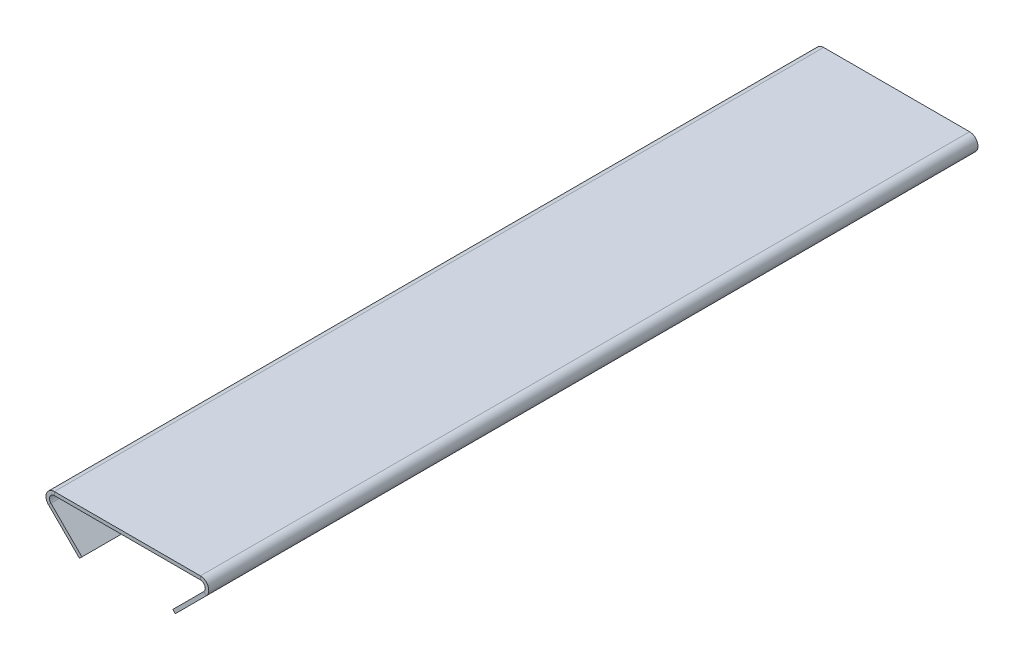
ISO-10303-21;
HEADER;
FILE_DESCRIPTION(('STEP AP214'),'2;1');
FILE_NAME('part.step','',(''),(''),'','','');
FILE_SCHEMA(('AUTOMOTIVE_DESIGN { 1 0 10303 214 1 1 1 1 }'));
ENDSEC;
DATA;
#1=APPLICATION_CONTEXT('core data for automotive mechanical design processes');
#2=APPLICATION_PROTOCOL_DEFINITION('international standard','automotive_design',2000,#1);
#3=PRODUCT_CONTEXT('',#1,'mechanical');
#4=PRODUCT('Part','Part','',(#3));
#5=PRODUCT_RELATED_PRODUCT_CATEGORY('part','',(#4));
#6=PRODUCT_DEFINITION_FORMATION('','',#4);
#7=PRODUCT_DEFINITION_CONTEXT('part definition',#1,'design');
#8=PRODUCT_DEFINITION('design','',#6,#7);
#9=PRODUCT_DEFINITION_SHAPE('','',#8);
#10=(LENGTH_UNIT() NAMED_UNIT(*) SI_UNIT(.MILLI.,.METRE.));
#11=(NAMED_UNIT(*) PLANE_ANGLE_UNIT() SI_UNIT($,.RADIAN.));
#12=(NAMED_UNIT(*) SI_UNIT($,.STERADIAN.) SOLID_ANGLE_UNIT());
#13=UNCERTAINTY_MEASURE_WITH_UNIT(LENGTH_MEASURE(1.E-05),#10,'distance_accuracy_value','');
#14=(GEOMETRIC_REPRESENTATION_CONTEXT(3) GLOBAL_UNCERTAINTY_ASSIGNED_CONTEXT((#13)) GLOBAL_UNIT_ASSIGNED_CONTEXT((#10,
#11,#12)) REPRESENTATION_CONTEXT('',''));
#15=CARTESIAN_POINT('',(0.,0.,0.));
#16=DIRECTION('',(0.,0.,1.));
#17=DIRECTION('',(1.,0.,0.));
#18=AXIS2_PLACEMENT_3D('',#15,#16,#17);
#19=CARTESIAN_POINT('',(0.,-1.36652,0.));
#20=DIRECTION('',(0.,1.,0.));
#21=DIRECTION('',(0.,0.,1.));
#22=AXIS2_PLACEMENT_3D('',#19,#20,#21);
#23=PLANE('',#22);
#24=DIRECTION('',(0.,0.,-1.));
#25=VECTOR('',#24,1.);
#26=CARTESIAN_POINT('',(-43.4683720464252,-1.36652000000001,-64.8734177215191));
#27=LINE('',#26,#25);
#28=CARTESIAN_POINT('',(-43.4683720464252,-1.36652000000001,-64.8734177215191));
#29=VERTEX_POINT('',#28);
#30=CARTESIAN_POINT('',(-43.4683720464252,-1.36651999999994,235.126582278481));
#31=VERTEX_POINT('',#30);
#32=EDGE_CURVE('E316',#29,#31,#27,.F.);
#33=ORIENTED_EDGE('',*,*,#32,.F.);
#34=DIRECTION('',(-1.,0.,0.));
#35=VECTOR('',#34,1.);
#36=CARTESIAN_POINT('',(-50.0000000000001,-1.36652,-64.8734177215191));
#37=LINE('',#36,#35);
#38=CARTESIAN_POINT('',(13.4683720464251,-1.36652000000003,-64.8734177215191));
#39=VERTEX_POINT('',#38);
#40=EDGE_CURVE('E13',#39,#29,#37,.T.);
#41=ORIENTED_EDGE('',*,*,#40,.F.);
#42=DIRECTION('',(0.,0.,1.));
#43=VECTOR('',#42,1.);
#44=CARTESIAN_POINT('',(13.4683720464251,-1.36652,235.126582278481));
#45=LINE('',#44,#43);
#46=CARTESIAN_POINT('',(13.4683720464251,-1.36652,235.126582278481));
#47=VERTEX_POINT('',#46);
#48=EDGE_CURVE('E144',#47,#39,#45,.F.);
#49=ORIENTED_EDGE('',*,*,#48,.F.);
#50=DIRECTION('',(1.,0.,0.));
#51=VECTOR('',#50,1.);
#52=CARTESIAN_POINT('',(-50.0000000000001,-1.36652,235.126582278481));
#53=LINE('',#52,#51);
#54=EDGE_CURVE('E85',#31,#47,#53,.T.);
#55=ORIENTED_EDGE('',*,*,#54,.F.);
#56=EDGE_LOOP('',(#33,#41,#49,#55));
#57=FACE_BOUND('',#56,.T.);
#58=ADVANCED_FACE('F76',(#57),#23,.F.);
#59=CARTESIAN_POINT('',(0.,0.,0.));
#60=DIRECTION('',(0.,1.,0.));
#61=DIRECTION('',(0.,0.,1.));
#62=AXIS2_PLACEMENT_3D('',#59,#60,#61);
#63=PLANE('',#62);
#64=DIRECTION('',(-1.,0.,0.));
#65=VECTOR('',#64,1.);
#66=CARTESIAN_POINT('',(-50.0000000000001,0.,-64.8734177215191));
#67=LINE('',#66,#65);
#68=CARTESIAN_POINT('',(13.4683720464251,0.,-64.8734177215191));
#69=VERTEX_POINT('',#68);
#70=CARTESIAN_POINT('',(-43.4683720464252,0.,-64.8734177215191));
#71=VERTEX_POINT('',#70);
#72=EDGE_CURVE('E80',#69,#71,#67,.T.);
#73=ORIENTED_EDGE('',*,*,#72,.T.);
#74=DIRECTION('',(0.,0.,-1.));
#75=VECTOR('',#74,1.);
#76=CARTESIAN_POINT('',(-43.4683720464252,0.,-64.8734177215191));
#77=LINE('',#76,#75);
#78=CARTESIAN_POINT('',(-43.4683720464252,0.,235.126582278481));
#79=VERTEX_POINT('',#78);
#80=EDGE_CURVE('E187',#71,#79,#77,.F.);
#81=ORIENTED_EDGE('',*,*,#80,.T.);
#82=DIRECTION('',(1.,0.,0.));
#83=VECTOR('',#82,1.);
#84=CARTESIAN_POINT('',(-50.0000000000001,0.,235.126582278481));
#85=LINE('',#84,#83);
#86=CARTESIAN_POINT('',(13.4683720464251,0.,235.126582278481));
#87=VERTEX_POINT('',#86);
#88=EDGE_CURVE('E102',#79,#87,#85,.T.);
#89=ORIENTED_EDGE('',*,*,#88,.T.);
#90=DIRECTION('',(0.,0.,1.));
#91=VECTOR('',#90,1.);
#92=CARTESIAN_POINT('',(13.4683720464251,0.,235.126582278481));
#93=LINE('',#92,#91);
#94=EDGE_CURVE('E171',#87,#69,#93,.F.);
#95=ORIENTED_EDGE('',*,*,#94,.T.);
#96=EDGE_LOOP('',(#73,#81,#89,#95));
#97=FACE_BOUND('',#96,.T.);
#98=ADVANCED_FACE('F184',(#97),#63,.T.);
#99=CARTESIAN_POINT('',(-50.0000000000001,-1.36652,-64.8734177215191));
#100=DIRECTION('',(0.,0.,-1.));
#101=DIRECTION('',(-1.,0.,0.));
#102=AXIS2_PLACEMENT_3D('',#99,#100,#101);
#103=PLANE('',#102);
#104=ORIENTED_EDGE('',*,*,#40,.T.);
#105=DIRECTION('',(0.,1.,0.));
#106=VECTOR('',#105,1.);
#107=CARTESIAN_POINT('',(-43.4683720464252,-1.36652000000001,-64.8734177215191));
#108=LINE('',#107,#106);
#109=EDGE_CURVE('E196',#29,#71,#108,.T.);
#110=ORIENTED_EDGE('',*,*,#109,.T.);
#111=ORIENTED_EDGE('',*,*,#72,.F.);
#112=DIRECTION('',(0.,1.,0.));
#113=VECTOR('',#112,1.);
#114=CARTESIAN_POINT('',(13.4683720464251,-1.36652000000003,-64.8734177215191));
#115=LINE('',#114,#113);
#116=EDGE_CURVE('E178',#39,#69,#115,.T.);
#117=ORIENTED_EDGE('',*,*,#116,.F.);
#118=EDGE_LOOP('',(#104,#110,#111,#117));
#119=FACE_BOUND('',#118,.T.);
#120=ADVANCED_FACE('F193',(#119),#103,.T.);
#121=CARTESIAN_POINT('',(-50.0000000000001,-1.36652,235.126582278481));
#122=DIRECTION('',(0.,0.,1.));
#123=DIRECTION('',(1.,0.,0.));
#124=AXIS2_PLACEMENT_3D('',#121,#122,#123);
#125=PLANE('',#124);
#126=DIRECTION('',(0.,1.,0.));
#127=VECTOR('',#126,1.);
#128=CARTESIAN_POINT('',(-43.4683720464252,-1.36651999999994,235.126582278481));
#129=LINE('',#128,#127);
#130=EDGE_CURVE('E170',#31,#79,#129,.T.);
#131=ORIENTED_EDGE('',*,*,#130,.F.);
#132=ORIENTED_EDGE('',*,*,#54,.T.);
#133=DIRECTION('',(0.,1.,0.));
#134=VECTOR('',#133,1.);
#135=CARTESIAN_POINT('',(13.4683720464251,-1.36652,235.126582278481));
#136=LINE('',#135,#134);
#137=EDGE_CURVE('E143',#47,#87,#136,.T.);
#138=ORIENTED_EDGE('',*,*,#137,.T.);
#139=ORIENTED_EDGE('',*,*,#88,.F.);
#140=EDGE_LOOP('',(#131,#132,#138,#139));
#141=FACE_BOUND('',#140,.T.);
#142=ADVANCED_FACE('F78',(#141),#125,.T.);
#143=CARTESIAN_POINT('',(13.4683720464251,-3.27152000000001,-64.8734177215191));
#144=DIRECTION('',(0.,0.,-1.));
#145=DIRECTION('',(0.,1.,0.));
#146=AXIS2_PLACEMENT_3D('',#143,#144,#145);
#147=PLANE('',#146);
#148=DIRECTION('',(0.707106781186549,-0.707106781186546,0.));
#149=VECTOR('',#148,1.);
#150=CARTESIAN_POINT('',(15.7816860232125,-5.58483397678741,-64.8734177215191));
#151=LINE('',#150,#149);
#152=CARTESIAN_POINT('',(14.8154104645854,-4.61855841816036,-64.8734177215191));
#153=VERTEX_POINT('',#152);
#154=CARTESIAN_POINT('',(15.7816860232125,-5.5848339767874,-64.8734177215191));
#155=VERTEX_POINT('',#154);
#156=EDGE_CURVE('E133',#153,#155,#151,.T.);
#157=ORIENTED_EDGE('',*,*,#156,.F.);
#158=CARTESIAN_POINT('',(13.4683720464251,-3.27152000000001,-64.8734177215191));
#159=DIRECTION('',(0.,0.,1.));
#160=DIRECTION('',(0.,-1.,0.));
#161=AXIS2_PLACEMENT_3D('',#158,#159,#160);
#162=CIRCLE('',#161,1.90499999999998);
#163=EDGE_CURVE('E127',#39,#153,#162,.F.);
#164=ORIENTED_EDGE('',*,*,#163,.F.);
#165=ORIENTED_EDGE('',*,*,#116,.T.);
#166=CARTESIAN_POINT('',(13.4683720464251,-3.27152000000001,-64.8734177215191));
#167=DIRECTION('',(0.,0.,1.));
#168=DIRECTION('',(0.,-1.,0.));
#169=AXIS2_PLACEMENT_3D('',#166,#167,#168);
#170=CIRCLE('',#169,3.27151999999997);
#171=EDGE_CURVE('E93',#69,#155,#170,.F.);
#172=ORIENTED_EDGE('',*,*,#171,.T.);
#173=EDGE_LOOP('',(#157,#164,#165,#172));
#174=FACE_BOUND('',#173,.T.);
#175=ADVANCED_FACE('F354',(#174),#147,.T.);
#176=CARTESIAN_POINT('',(13.4683720464251,-3.27151999999998,235.126582278481));
#177=DIRECTION('',(0.,0.,-1.));
#178=DIRECTION('',(0.,1.,0.));
#179=AXIS2_PLACEMENT_3D('',#176,#177,#178);
#180=PLANE('',#179);
#181=CARTESIAN_POINT('',(13.4683720464251,-3.27151999999998,235.126582278481));
#182=DIRECTION('',(0.,0.,1.));
#183=DIRECTION('',(0.,-1.,0.));
#184=AXIS2_PLACEMENT_3D('',#181,#182,#183);
#185=CIRCLE('',#184,1.90499999999998);
#186=CARTESIAN_POINT('',(14.8154104645854,-4.61855841816033,235.126582278481));
#187=VERTEX_POINT('',#186);
#188=EDGE_CURVE('E124',#187,#47,#185,.T.);
#189=ORIENTED_EDGE('',*,*,#188,.F.);
#190=DIRECTION('',(0.707106781186549,-0.707106781186546,0.));
#191=VECTOR('',#190,1.);
#192=CARTESIAN_POINT('',(14.8154104645855,-4.61855841816036,235.126582278481));
#193=LINE('',#192,#191);
#194=CARTESIAN_POINT('',(15.7816860232125,-5.5848339767874,235.126582278481));
#195=VERTEX_POINT('',#194);
#196=EDGE_CURVE('E132',#187,#195,#193,.T.);
#197=ORIENTED_EDGE('',*,*,#196,.T.);
#198=CARTESIAN_POINT('',(13.4683720464251,-3.27151999999998,235.126582278481));
#199=DIRECTION('',(0.,0.,1.));
#200=DIRECTION('',(0.,-1.,0.));
#201=AXIS2_PLACEMENT_3D('',#198,#199,#200);
#202=CIRCLE('',#201,3.27151999999997);
#203=EDGE_CURVE('E173',#195,#87,#202,.T.);
#204=ORIENTED_EDGE('',*,*,#203,.T.);
#205=ORIENTED_EDGE('',*,*,#137,.F.);
#206=EDGE_LOOP('',(#189,#197,#204,#205));
#207=FACE_BOUND('',#206,.T.);
#208=ADVANCED_FACE('F138',(#207),#180,.F.);
#209=CARTESIAN_POINT('',(13.4683720464251,-3.27151999999998,235.126582278481));
#210=DIRECTION('',(0.,0.,1.));
#211=DIRECTION('',(0.707106781186549,-0.707106781186546,0.));
#212=AXIS2_PLACEMENT_3D('',#209,#210,#211);
#213=CYLINDRICAL_SURFACE('',#212,3.27151999999997);
#214=ORIENTED_EDGE('',*,*,#94,.F.);
#215=ORIENTED_EDGE('',*,*,#203,.F.);
#216=DIRECTION('',(0.,0.,1.));
#217=VECTOR('',#216,1.);
#218=CARTESIAN_POINT('',(15.7816860232125,-5.58483397678741,0.));
#219=LINE('',#218,#217);
#220=EDGE_CURVE('E162',#155,#195,#219,.T.);
#221=ORIENTED_EDGE('',*,*,#220,.F.);
#222=ORIENTED_EDGE('',*,*,#171,.F.);
#223=EDGE_LOOP('',(#214,#215,#221,#222));
#224=FACE_BOUND('',#223,.T.);
#225=ADVANCED_FACE('F365',(#224),#213,.T.);
#226=CARTESIAN_POINT('',(13.4683720464251,-3.27151999999998,235.126582278481));
#227=DIRECTION('',(0.,0.,1.));
#228=DIRECTION('',(0.707106781186549,-0.707106781186546,0.));
#229=AXIS2_PLACEMENT_3D('',#226,#227,#228);
#230=CYLINDRICAL_SURFACE('',#229,1.90499999999998);
#231=ORIENTED_EDGE('',*,*,#48,.T.);
#232=ORIENTED_EDGE('',*,*,#163,.T.);
#233=DIRECTION('',(0.,0.,-1.));
#234=VECTOR('',#233,1.);
#235=CARTESIAN_POINT('',(14.8154104645854,-4.61855841816037,-64.8734177215191));
#236=LINE('',#235,#234);
#237=EDGE_CURVE('E121',#153,#187,#236,.F.);
#238=ORIENTED_EDGE('',*,*,#237,.T.);
#239=ORIENTED_EDGE('',*,*,#188,.T.);
#240=EDGE_LOOP('',(#231,#232,#238,#239));
#241=FACE_BOUND('',#240,.T.);
#242=ADVANCED_FACE('F123',(#241),#230,.F.);
#243=CARTESIAN_POINT('',(19.0337244413729,-2.33279555862704,235.126582278481));
#244=DIRECTION('',(0.,0.,1.));
#245=DIRECTION('',(1.,0.,0.));
#246=AXIS2_PLACEMENT_3D('',#243,#244,#245);
#247=PLANE('',#246);
#248=DIRECTION('',(0.707106781186546,0.707106781186549,0.));
#249=VECTOR('',#248,1.);
#250=CARTESIAN_POINT('',(19.0337244413729,-2.33279555862704,235.126582278481));
#251=LINE('',#250,#249);
#252=CARTESIAN_POINT('',(3.68885047033623,-17.6776695296637,235.126582278481));
#253=VERTEX_POINT('',#252);
#254=EDGE_CURVE('E161',#253,#195,#251,.T.);
#255=ORIENTED_EDGE('',*,*,#254,.T.);
#256=ORIENTED_EDGE('',*,*,#196,.F.);
#257=DIRECTION('',(-0.707106781186546,-0.707106781186549,0.));
#258=VECTOR('',#257,1.);
#259=CARTESIAN_POINT('',(8.75070888274591,-10.6832599999999,235.126582278481));
#260=LINE('',#259,#258);
#261=CARTESIAN_POINT('',(2.72257491170919,-16.7113939710367,235.126582278481));
#262=VERTEX_POINT('',#261);
#263=EDGE_CURVE('E149',#262,#187,#260,.F.);
#264=ORIENTED_EDGE('',*,*,#263,.F.);
#265=DIRECTION('',(-0.707106781186549,0.707106781186546,0.));
#266=VECTOR('',#265,1.);
#267=CARTESIAN_POINT('',(3.68885047033623,-17.6776695296637,235.126582278481));
#268=LINE('',#267,#266);
#269=EDGE_CURVE('E145',#253,#262,#268,.T.);
#270=ORIENTED_EDGE('',*,*,#269,.F.);
#271=EDGE_LOOP('',(#255,#256,#264,#270));
#272=FACE_BOUND('',#271,.T.);
#273=ADVANCED_FACE('F159',(#272),#247,.T.);
#274=CARTESIAN_POINT('',(3.68885047033619,-17.6776695296637,-64.8734177215191));
#275=DIRECTION('',(0.,0.,-1.));
#276=DIRECTION('',(-1.,0.,0.));
#277=AXIS2_PLACEMENT_3D('',#274,#275,#276);
#278=PLANE('',#277);
#279=DIRECTION('',(0.707106781186546,0.707106781186549,0.));
#280=VECTOR('',#279,1.);
#281=CARTESIAN_POINT('',(8.75070888274588,-10.6832599999999,-64.8734177215191));
#282=LINE('',#281,#280);
#283=CARTESIAN_POINT('',(2.72257491170915,-16.7113939710367,-64.8734177215191));
#284=VERTEX_POINT('',#283);
#285=EDGE_CURVE('E164',#153,#284,#282,.F.);
#286=ORIENTED_EDGE('',*,*,#285,.F.);
#287=ORIENTED_EDGE('',*,*,#156,.T.);
#288=DIRECTION('',(-0.707106781186546,-0.707106781186549,0.));
#289=VECTOR('',#288,1.);
#290=CARTESIAN_POINT('',(3.68885047033619,-17.6776695296637,-64.8734177215191));
#291=LINE('',#290,#289);
#292=CARTESIAN_POINT('',(3.68885047033619,-17.6776695296637,-64.8734177215191));
#293=VERTEX_POINT('',#292);
#294=EDGE_CURVE('E156',#155,#293,#291,.T.);
#295=ORIENTED_EDGE('',*,*,#294,.T.);
#296=DIRECTION('',(-0.707106781186549,0.707106781186546,0.));
#297=VECTOR('',#296,1.);
#298=CARTESIAN_POINT('',(3.68885047033619,-17.6776695296637,-64.8734177215191));
#299=LINE('',#298,#297);
#300=EDGE_CURVE('E212',#293,#284,#299,.T.);
#301=ORIENTED_EDGE('',*,*,#300,.T.);
#302=EDGE_LOOP('',(#286,#287,#295,#301));
#303=FACE_BOUND('',#302,.T.);
#304=ADVANCED_FACE('F224',(#303),#278,.T.);
#305=CARTESIAN_POINT('',(9.71698444137293,-11.649535558627,0.));
#306=DIRECTION('',(0.707106781186549,-0.707106781186546,0.));
#307=DIRECTION('',(0.707106781186546,0.707106781186549,0.));
#308=AXIS2_PLACEMENT_3D('',#305,#306,#307);
#309=PLANE('',#308);
#310=ORIENTED_EDGE('',*,*,#294,.F.);
#311=ORIENTED_EDGE('',*,*,#220,.T.);
#312=ORIENTED_EDGE('',*,*,#254,.F.);
#313=DIRECTION('',(0.,0.,1.));
#314=VECTOR('',#313,1.);
#315=CARTESIAN_POINT('',(3.68885047033623,-17.6776695296637,235.126582278481));
#316=LINE('',#315,#314);
#317=EDGE_CURVE('E216',#293,#253,#316,.T.);
#318=ORIENTED_EDGE('',*,*,#317,.F.);
#319=EDGE_LOOP('',(#310,#311,#312,#318));
#320=FACE_BOUND('',#319,.T.);
#321=ADVANCED_FACE('F364',(#320),#309,.T.);
#322=CARTESIAN_POINT('',(8.75070888274589,-10.6832599999999,0.));
#323=DIRECTION('',(0.707106781186549,-0.707106781186546,0.));
#324=DIRECTION('',(0.707106781186546,0.707106781186549,0.));
#325=AXIS2_PLACEMENT_3D('',#322,#323,#324);
#326=PLANE('',#325);
#327=ORIENTED_EDGE('',*,*,#237,.F.);
#328=ORIENTED_EDGE('',*,*,#285,.T.);
#329=DIRECTION('',(0.,0.,-1.));
#330=VECTOR('',#329,1.);
#331=CARTESIAN_POINT('',(2.72257491170916,-16.7113939710367,0.));
#332=LINE('',#331,#330);
#333=EDGE_CURVE('E153',#284,#262,#332,.F.);
#334=ORIENTED_EDGE('',*,*,#333,.T.);
#335=ORIENTED_EDGE('',*,*,#263,.T.);
#336=EDGE_LOOP('',(#327,#328,#334,#335));
#337=FACE_BOUND('',#336,.T.);
#338=ADVANCED_FACE('F150',(#337),#326,.F.);
#339=CARTESIAN_POINT('',(3.68885047033623,-17.6776695296637,235.126582278481));
#340=DIRECTION('',(-0.707106781186546,-0.707106781186549,0.));
#341=DIRECTION('',(0.707106781186549,-0.707106781186546,0.));
#342=AXIS2_PLACEMENT_3D('',#339,#340,#341);
#343=PLANE('',#342);
#344=ORIENTED_EDGE('',*,*,#333,.F.);
#345=ORIENTED_EDGE('',*,*,#300,.F.);
#346=ORIENTED_EDGE('',*,*,#317,.T.);
#347=ORIENTED_EDGE('',*,*,#269,.T.);
#348=EDGE_LOOP('',(#344,#345,#346,#347));
#349=FACE_BOUND('',#348,.T.);
#350=ADVANCED_FACE('F229',(#349),#343,.T.);
#351=CARTESIAN_POINT('',(-43.4683720464253,-3.27151999999999,235.126582278481));
#352=DIRECTION('',(0.,0.,1.));
#353=DIRECTION('',(0.,-1.,0.));
#354=AXIS2_PLACEMENT_3D('',#351,#352,#353);
#355=PLANE('',#354);
#356=DIRECTION('',(0.707106781186549,0.707106781186546,0.));
#357=VECTOR('',#356,1.);
#358=CARTESIAN_POINT('',(-45.7816860232127,-5.58483397678741,235.126582278481));
#359=LINE('',#358,#357);
#360=CARTESIAN_POINT('',(-44.8154104645857,-4.61855841816039,235.126582278481));
#361=VERTEX_POINT('',#360);
#362=CARTESIAN_POINT('',(-45.7816860232127,-5.58483397678743,235.126582278481));
#363=VERTEX_POINT('',#362);
#364=EDGE_CURVE('E292',#361,#363,#359,.F.);
#365=ORIENTED_EDGE('',*,*,#364,.F.);
#366=CARTESIAN_POINT('',(-43.4683720464253,-3.27151999999999,235.126582278481));
#367=DIRECTION('',(0.,0.,-1.));
#368=DIRECTION('',(0.,1.,0.));
#369=AXIS2_PLACEMENT_3D('',#366,#367,#368);
#370=CIRCLE('',#369,1.90500000000005);
#371=EDGE_CURVE('E313',#31,#361,#370,.F.);
#372=ORIENTED_EDGE('',*,*,#371,.F.);
#373=ORIENTED_EDGE('',*,*,#130,.T.);
#374=CARTESIAN_POINT('',(-43.4683720464253,-3.27151999999999,235.126582278481));
#375=DIRECTION('',(0.,0.,-1.));
#376=DIRECTION('',(0.,1.,0.));
#377=AXIS2_PLACEMENT_3D('',#374,#375,#376);
#378=CIRCLE('',#377,3.27152000000005);
#379=EDGE_CURVE('E202',#79,#363,#378,.F.);
#380=ORIENTED_EDGE('',*,*,#379,.T.);
#381=EDGE_LOOP('',(#365,#372,#373,#380));
#382=FACE_BOUND('',#381,.T.);
#383=ADVANCED_FACE('F378',(#382),#355,.T.);
#384=CARTESIAN_POINT('',(-43.4683720464253,-3.27152000000005,-64.8734177215191));
#385=DIRECTION('',(0.,0.,1.));
#386=DIRECTION('',(0.,-1.,0.));
#387=AXIS2_PLACEMENT_3D('',#384,#385,#386);
#388=PLANE('',#387);
#389=CARTESIAN_POINT('',(-43.4683720464253,-3.27152000000005,-64.8734177215191));
#390=DIRECTION('',(0.,0.,-1.));
#391=DIRECTION('',(0.,1.,0.));
#392=AXIS2_PLACEMENT_3D('',#389,#390,#391);
#393=CIRCLE('',#392,1.90500000000005);
#394=CARTESIAN_POINT('',(-44.8154104645857,-4.61855841816045,-64.8734177215191));
#395=VERTEX_POINT('',#394);
#396=EDGE_CURVE('E317',#395,#29,#393,.T.);
#397=ORIENTED_EDGE('',*,*,#396,.F.);
#398=DIRECTION('',(0.707106781186549,0.707106781186546,0.));
#399=VECTOR('',#398,1.);
#400=CARTESIAN_POINT('',(-44.8154104645856,-4.61855841816041,-64.8734177215191));
#401=LINE('',#400,#399);
#402=CARTESIAN_POINT('',(-45.7816860232127,-5.58483397678745,-64.8734177215191));
#403=VERTEX_POINT('',#402);
#404=EDGE_CURVE('E304',#395,#403,#401,.F.);
#405=ORIENTED_EDGE('',*,*,#404,.T.);
#406=CARTESIAN_POINT('',(-43.4683720464253,-3.27152000000005,-64.8734177215191));
#407=DIRECTION('',(0.,0.,-1.));
#408=DIRECTION('',(0.,1.,0.));
#409=AXIS2_PLACEMENT_3D('',#406,#407,#408);
#410=CIRCLE('',#409,3.27152000000005);
#411=EDGE_CURVE('E310',#403,#71,#410,.T.);
#412=ORIENTED_EDGE('',*,*,#411,.T.);
#413=ORIENTED_EDGE('',*,*,#109,.F.);
#414=EDGE_LOOP('',(#397,#405,#412,#413));
#415=FACE_BOUND('',#414,.T.);
#416=ADVANCED_FACE('F328',(#415),#388,.F.);
#417=CARTESIAN_POINT('',(-43.4683720464253,-3.27152000000005,-64.8734177215191));
#418=DIRECTION('',(0.,0.,-1.));
#419=DIRECTION('',(-0.707106781186549,-0.707106781186546,0.));
#420=AXIS2_PLACEMENT_3D('',#417,#418,#419);
#421=CYLINDRICAL_SURFACE('',#420,3.27152000000005);
#422=ORIENTED_EDGE('',*,*,#80,.F.);
#423=ORIENTED_EDGE('',*,*,#411,.F.);
#424=DIRECTION('',(0.,0.,-1.));
#425=VECTOR('',#424,1.);
#426=CARTESIAN_POINT('',(-45.7816860232127,-5.58483397678742,235.126582278481));
#427=LINE('',#426,#425);
#428=EDGE_CURVE('E302',#403,#363,#427,.F.);
#429=ORIENTED_EDGE('',*,*,#428,.T.);
#430=ORIENTED_EDGE('',*,*,#379,.F.);
#431=EDGE_LOOP('',(#422,#423,#429,#430));
#432=FACE_BOUND('',#431,.T.);
#433=ADVANCED_FACE('F337',(#432),#421,.T.);
#434=CARTESIAN_POINT('',(-43.4683720464253,-3.27152000000005,-64.8734177215191));
#435=DIRECTION('',(0.,0.,-1.));
#436=DIRECTION('',(-0.707106781186549,-0.707106781186546,0.));
#437=AXIS2_PLACEMENT_3D('',#434,#435,#436);
#438=CYLINDRICAL_SURFACE('',#437,1.90500000000005);
#439=ORIENTED_EDGE('',*,*,#32,.T.);
#440=ORIENTED_EDGE('',*,*,#371,.T.);
#441=DIRECTION('',(0.,0.,-1.));
#442=VECTOR('',#441,1.);
#443=CARTESIAN_POINT('',(-44.8154104645857,-4.61855841816038,235.126582278481));
#444=LINE('',#443,#442);
#445=EDGE_CURVE('E307',#361,#395,#444,.T.);
#446=ORIENTED_EDGE('',*,*,#445,.T.);
#447=ORIENTED_EDGE('',*,*,#396,.T.);
#448=EDGE_LOOP('',(#439,#440,#446,#447));
#449=FACE_BOUND('',#448,.T.);
#450=ADVANCED_FACE('F325',(#449),#438,.F.);
#451=CARTESIAN_POINT('',(-33.6888504703364,-17.6776695296637,-64.8734177215191));
#452=DIRECTION('',(0.,0.,1.));
#453=DIRECTION('',(1.,0.,0.));
#454=AXIS2_PLACEMENT_3D('',#451,#452,#453);
#455=PLANE('',#454);
#456=ORIENTED_EDGE('',*,*,#404,.F.);
#457=DIRECTION('',(-0.707106781186546,0.707106781186549,0.));
#458=VECTOR('',#457,1.);
#459=CARTESIAN_POINT('',(-32.7225749117094,-16.7113939710367,-64.8734177215191));
#460=LINE('',#459,#458);
#461=CARTESIAN_POINT('',(-32.7225749117094,-16.7113939710367,-64.8734177215191));
#462=VERTEX_POINT('',#461);
#463=EDGE_CURVE('E300',#395,#462,#460,.F.);
#464=ORIENTED_EDGE('',*,*,#463,.T.);
#465=DIRECTION('',(0.707106781186549,0.707106781186546,0.));
#466=VECTOR('',#465,1.);
#467=CARTESIAN_POINT('',(-33.6888504703364,-17.6776695296637,-64.8734177215191));
#468=LINE('',#467,#466);
#469=CARTESIAN_POINT('',(-33.6888504703364,-17.6776695296637,-64.8734177215191));
#470=VERTEX_POINT('',#469);
#471=EDGE_CURVE('E288',#470,#462,#468,.T.);
#472=ORIENTED_EDGE('',*,*,#471,.F.);
#473=DIRECTION('',(0.707106781186546,-0.707106781186549,0.));
#474=VECTOR('',#473,1.);
#475=CARTESIAN_POINT('',(-24.7169844413731,-26.6495355586271,-64.8734177215191));
#476=LINE('',#475,#474);
#477=EDGE_CURVE('E275',#403,#470,#476,.T.);
#478=ORIENTED_EDGE('',*,*,#477,.F.);
#479=EDGE_LOOP('',(#456,#464,#472,#478));
#480=FACE_BOUND('',#479,.T.);
#481=ADVANCED_FACE('F329',(#480),#455,.F.);
#482=CARTESIAN_POINT('',(-49.0337244413731,-2.33279555862704,235.126582278481));
#483=DIRECTION('',(0.,0.,-1.));
#484=DIRECTION('',(-1.,0.,0.));
#485=AXIS2_PLACEMENT_3D('',#482,#483,#484);
#486=PLANE('',#485);
#487=ORIENTED_EDGE('',*,*,#364,.T.);
#488=DIRECTION('',(-0.707106781186546,0.707106781186549,0.));
#489=VECTOR('',#488,1.);
#490=CARTESIAN_POINT('',(-24.7169844413731,-26.6495355586271,235.126582278481));
#491=LINE('',#490,#489);
#492=CARTESIAN_POINT('',(-33.6888504703365,-17.6776695296637,235.126582278481));
#493=VERTEX_POINT('',#492);
#494=EDGE_CURVE('E273',#493,#363,#491,.T.);
#495=ORIENTED_EDGE('',*,*,#494,.F.);
#496=DIRECTION('',(0.707106781186549,0.707106781186546,0.));
#497=VECTOR('',#496,1.);
#498=CARTESIAN_POINT('',(-33.6888504703365,-17.6776695296637,235.126582278481));
#499=LINE('',#498,#497);
#500=CARTESIAN_POINT('',(-32.7225749117094,-16.7113939710367,235.126582278481));
#501=VERTEX_POINT('',#500);
#502=EDGE_CURVE('E281',#493,#501,#499,.T.);
#503=ORIENTED_EDGE('',*,*,#502,.T.);
#504=DIRECTION('',(0.707106781186546,-0.707106781186549,0.));
#505=VECTOR('',#504,1.);
#506=CARTESIAN_POINT('',(-48.0674488827461,-1.36652,235.126582278481));
#507=LINE('',#506,#505);
#508=EDGE_CURVE('E297',#501,#361,#507,.F.);
#509=ORIENTED_EDGE('',*,*,#508,.T.);
#510=EDGE_LOOP('',(#487,#495,#503,#509));
#511=FACE_BOUND('',#510,.T.);
#512=ADVANCED_FACE('F291',(#511),#486,.F.);
#513=CARTESIAN_POINT('',(-24.7169844413731,-26.6495355586271,0.));
#514=DIRECTION('',(0.707106781186549,0.707106781186546,0.));
#515=DIRECTION('',(-0.707106781186546,0.707106781186549,0.));
#516=AXIS2_PLACEMENT_3D('',#513,#514,#515);
#517=PLANE('',#516);
#518=ORIENTED_EDGE('',*,*,#428,.F.);
#519=ORIENTED_EDGE('',*,*,#477,.T.);
#520=DIRECTION('',(0.,0.,1.));
#521=VECTOR('',#520,1.);
#522=CARTESIAN_POINT('',(-33.6888504703364,-17.6776695296637,0.));
#523=LINE('',#522,#521);
#524=EDGE_CURVE('E268',#470,#493,#523,.T.);
#525=ORIENTED_EDGE('',*,*,#524,.T.);
#526=ORIENTED_EDGE('',*,*,#494,.T.);
#527=EDGE_LOOP('',(#518,#519,#525,#526));
#528=FACE_BOUND('',#527,.T.);
#529=ADVANCED_FACE('F271',(#528),#517,.F.);
#530=CARTESIAN_POINT('',(-23.7507088827461,-25.68326,0.));
#531=DIRECTION('',(0.707106781186549,0.707106781186546,0.));
#532=DIRECTION('',(-0.707106781186546,0.707106781186549,0.));
#533=AXIS2_PLACEMENT_3D('',#530,#531,#532);
#534=PLANE('',#533);
#535=ORIENTED_EDGE('',*,*,#463,.F.);
#536=ORIENTED_EDGE('',*,*,#445,.F.);
#537=ORIENTED_EDGE('',*,*,#508,.F.);
#538=DIRECTION('',(0.,0.,-1.));
#539=VECTOR('',#538,1.);
#540=CARTESIAN_POINT('',(-32.7225749117094,-16.7113939710367,235.126582278481));
#541=LINE('',#540,#539);
#542=EDGE_CURVE('E284',#462,#501,#541,.F.);
#543=ORIENTED_EDGE('',*,*,#542,.F.);
#544=EDGE_LOOP('',(#535,#536,#537,#543));
#545=FACE_BOUND('',#544,.T.);
#546=ADVANCED_FACE('F323',(#545),#534,.T.);
#547=CARTESIAN_POINT('',(-33.6888504703365,-17.6776695296637,235.126582278481));
#548=DIRECTION('',(-0.707106781186546,0.707106781186549,0.));
#549=DIRECTION('',(-0.707106781186549,-0.707106781186546,0.));
#550=AXIS2_PLACEMENT_3D('',#547,#548,#549);
#551=PLANE('',#550);
#552=ORIENTED_EDGE('',*,*,#542,.T.);
#553=ORIENTED_EDGE('',*,*,#502,.F.);
#554=ORIENTED_EDGE('',*,*,#524,.F.);
#555=ORIENTED_EDGE('',*,*,#471,.T.);
#556=EDGE_LOOP('',(#552,#553,#554,#555));
#557=FACE_BOUND('',#556,.T.);
#558=ADVANCED_FACE('F282',(#557),#551,.F.);
#559=CLOSED_SHELL('',(#58,#98,#120,#142,#175,#208,#225,#242,#273,#304,#321,#338,#350,#383,#416,
#433,#450,#481,#512,#529,#546,#558));
#560=MANIFOLD_SOLID_BREP('B2',#559);
#561=ADVANCED_BREP_SHAPE_REPRESENTATION('',(#18,#560),#14);
#562=SHAPE_DEFINITION_REPRESENTATION(#9,#561);
ENDSEC;
END-ISO-10303-21;
